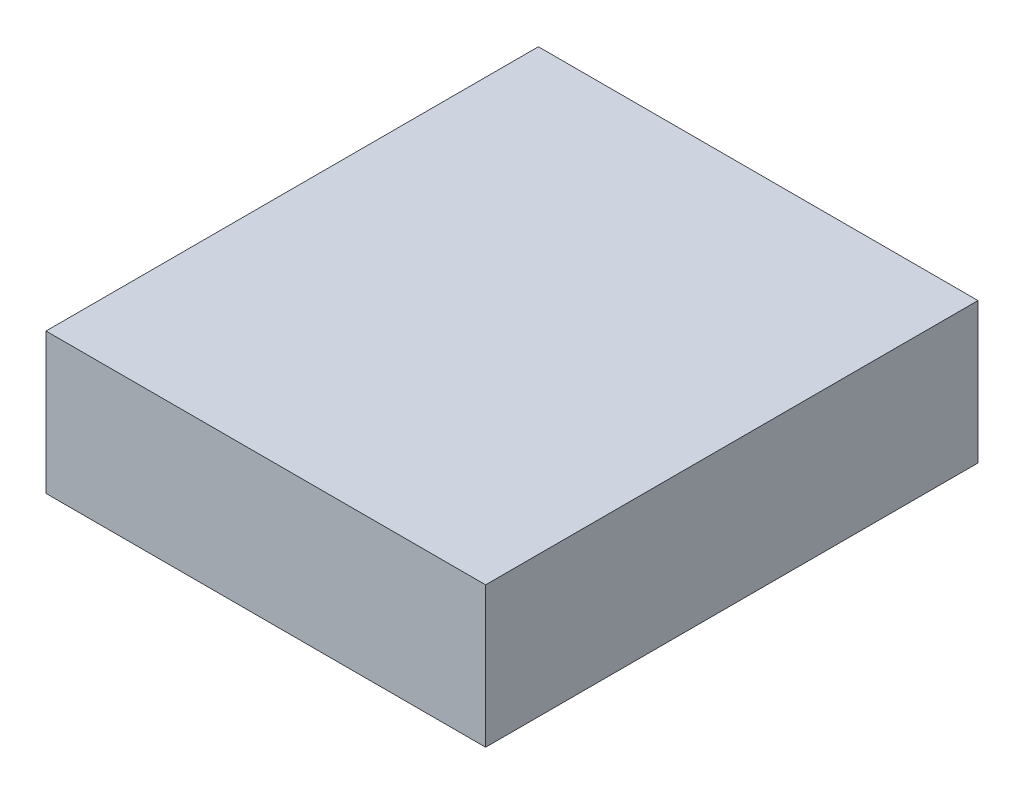
ISO-10303-21;
HEADER;
FILE_DESCRIPTION(('STEP AP214'),'2;1');
FILE_NAME('part.step','',(''),(''),'','','');
FILE_SCHEMA(('AUTOMOTIVE_DESIGN { 1 0 10303 214 1 1 1 1 }'));
ENDSEC;
DATA;
#1=APPLICATION_CONTEXT('core data for automotive mechanical design processes');
#2=APPLICATION_PROTOCOL_DEFINITION('international standard','automotive_design',2000,#1);
#3=PRODUCT_CONTEXT('',#1,'mechanical');
#4=PRODUCT('Part','Part','',(#3));
#5=PRODUCT_RELATED_PRODUCT_CATEGORY('part','',(#4));
#6=PRODUCT_DEFINITION_FORMATION('','',#4);
#7=PRODUCT_DEFINITION_CONTEXT('part definition',#1,'design');
#8=PRODUCT_DEFINITION('design','',#6,#7);
#9=PRODUCT_DEFINITION_SHAPE('','',#8);
#10=(LENGTH_UNIT() NAMED_UNIT(*) SI_UNIT(.MILLI.,.METRE.));
#11=(NAMED_UNIT(*) PLANE_ANGLE_UNIT() SI_UNIT($,.RADIAN.));
#12=(NAMED_UNIT(*) SI_UNIT($,.STERADIAN.) SOLID_ANGLE_UNIT());
#13=UNCERTAINTY_MEASURE_WITH_UNIT(LENGTH_MEASURE(1.E-05),#10,'distance_accuracy_value','');
#14=(GEOMETRIC_REPRESENTATION_CONTEXT(3) GLOBAL_UNCERTAINTY_ASSIGNED_CONTEXT((#13)) GLOBAL_UNIT_ASSIGNED_CONTEXT((#10,
#11,#12)) REPRESENTATION_CONTEXT('',''));
#15=CARTESIAN_POINT('',(0.,0.,0.));
#16=DIRECTION('',(0.,0.,1.));
#17=DIRECTION('',(1.,0.,0.));
#18=AXIS2_PLACEMENT_3D('',#15,#16,#17);
#19=CARTESIAN_POINT('',(-0.62500002,-0.1999996,0.));
#20=DIRECTION('',(0.,1.,0.));
#21=DIRECTION('',(0.,0.,1.));
#22=AXIS2_PLACEMENT_3D('',#19,#20,#21);
#23=PLANE('',#22);
#24=DIRECTION('',(0.,0.,1.));
#25=VECTOR('',#24,1.);
#26=CARTESIAN_POINT('',(0.62500002,-0.1999996,0.));
#27=LINE('',#26,#25);
#28=CARTESIAN_POINT('',(0.62500002,-0.1999996,0.));
#29=VERTEX_POINT('',#28);
#30=CARTESIAN_POINT('',(0.62500002,-0.1999996,1.39999974));
#31=VERTEX_POINT('',#30);
#32=EDGE_CURVE('E20',#29,#31,#27,.T.);
#33=ORIENTED_EDGE('',*,*,#32,.T.);
#34=DIRECTION('',(-1.,0.,0.));
#35=VECTOR('',#34,1.);
#36=CARTESIAN_POINT('',(0.62500002,-0.1999996,1.39999974));
#37=LINE('',#36,#35);
#38=CARTESIAN_POINT('',(-0.62500002,-0.1999996,1.39999974));
#39=VERTEX_POINT('',#38);
#40=EDGE_CURVE('E55',#31,#39,#37,.T.);
#41=ORIENTED_EDGE('',*,*,#40,.T.);
#42=DIRECTION('',(0.,0.,-1.));
#43=VECTOR('',#42,1.);
#44=CARTESIAN_POINT('',(-0.62500002,-0.1999996,0.));
#45=LINE('',#44,#43);
#46=CARTESIAN_POINT('',(-0.62500002,-0.1999996,0.));
#47=VERTEX_POINT('',#46);
#48=EDGE_CURVE('E74',#39,#47,#45,.T.);
#49=ORIENTED_EDGE('',*,*,#48,.T.);
#50=DIRECTION('',(-1.,0.,0.));
#51=VECTOR('',#50,1.);
#52=CARTESIAN_POINT('',(0.62500002,-0.1999996,0.));
#53=LINE('',#52,#51);
#54=EDGE_CURVE('E66',#29,#47,#53,.T.);
#55=ORIENTED_EDGE('',*,*,#54,.F.);
#56=EDGE_LOOP('',(#33,#41,#49,#55));
#57=FACE_BOUND('',#56,.T.);
#58=ADVANCED_FACE('F17',(#57),#23,.F.);
#59=CARTESIAN_POINT('',(0.62500002,-0.1999996,0.));
#60=DIRECTION('',(-1.,0.,0.));
#61=DIRECTION('',(0.,0.,1.));
#62=AXIS2_PLACEMENT_3D('',#59,#60,#61);
#63=PLANE('',#62);
#64=DIRECTION('',(0.,0.,-1.));
#65=VECTOR('',#64,1.);
#66=CARTESIAN_POINT('',(0.62500002,0.1999996,0.));
#67=LINE('',#66,#65);
#68=CARTESIAN_POINT('',(0.62500002,0.1999996,0.));
#69=VERTEX_POINT('',#68);
#70=CARTESIAN_POINT('',(0.62500002,0.1999996,1.39999974));
#71=VERTEX_POINT('',#70);
#72=EDGE_CURVE('E72',#69,#71,#67,.F.);
#73=ORIENTED_EDGE('',*,*,#72,.T.);
#74=DIRECTION('',(0.,1.,0.));
#75=VECTOR('',#74,1.);
#76=CARTESIAN_POINT('',(0.62500002,-0.1999996,1.39999974));
#77=LINE('',#76,#75);
#78=EDGE_CURVE('E62',#71,#31,#77,.F.);
#79=ORIENTED_EDGE('',*,*,#78,.T.);
#80=ORIENTED_EDGE('',*,*,#32,.F.);
#81=DIRECTION('',(0.,1.,0.));
#82=VECTOR('',#81,1.);
#83=CARTESIAN_POINT('',(0.62500002,-0.1999996,0.));
#84=LINE('',#83,#82);
#85=EDGE_CURVE('E80',#69,#29,#84,.F.);
#86=ORIENTED_EDGE('',*,*,#85,.F.);
#87=EDGE_LOOP('',(#73,#79,#80,#86));
#88=FACE_BOUND('',#87,.T.);
#89=ADVANCED_FACE('F71',(#88),#63,.F.);
#90=CARTESIAN_POINT('',(0.62500002,-0.1999996,1.39999974));
#91=DIRECTION('',(0.,0.,-1.));
#92=DIRECTION('',(-1.,0.,0.));
#93=AXIS2_PLACEMENT_3D('',#90,#91,#92);
#94=PLANE('',#93);
#95=DIRECTION('',(1.,0.,0.));
#96=VECTOR('',#95,1.);
#97=CARTESIAN_POINT('',(0.62500002,0.1999996,1.39999974));
#98=LINE('',#97,#96);
#99=CARTESIAN_POINT('',(-0.62500002,0.1999996,1.39999974));
#100=VERTEX_POINT('',#99);
#101=EDGE_CURVE('E83',#71,#100,#98,.F.);
#102=ORIENTED_EDGE('',*,*,#101,.T.);
#103=DIRECTION('',(0.,1.,0.));
#104=VECTOR('',#103,1.);
#105=CARTESIAN_POINT('',(-0.62500002,0.1999996,1.39999974));
#106=LINE('',#105,#104);
#107=EDGE_CURVE('E64',#100,#39,#106,.F.);
#108=ORIENTED_EDGE('',*,*,#107,.T.);
#109=ORIENTED_EDGE('',*,*,#40,.F.);
#110=ORIENTED_EDGE('',*,*,#78,.F.);
#111=EDGE_LOOP('',(#102,#108,#109,#110));
#112=FACE_BOUND('',#111,.T.);
#113=ADVANCED_FACE('F60',(#112),#94,.F.);
#114=CARTESIAN_POINT('',(-0.62500002,0.1999996,0.));
#115=DIRECTION('',(1.,0.,0.));
#116=DIRECTION('',(0.,0.,-1.));
#117=AXIS2_PLACEMENT_3D('',#114,#115,#116);
#118=PLANE('',#117);
#119=ORIENTED_EDGE('',*,*,#48,.F.);
#120=ORIENTED_EDGE('',*,*,#107,.F.);
#121=DIRECTION('',(0.,0.,-1.));
#122=VECTOR('',#121,1.);
#123=CARTESIAN_POINT('',(-0.62500002,0.1999996,0.));
#124=LINE('',#123,#122);
#125=CARTESIAN_POINT('',(-0.62500002,0.1999996,0.));
#126=VERTEX_POINT('',#125);
#127=EDGE_CURVE('E26',#100,#126,#124,.T.);
#128=ORIENTED_EDGE('',*,*,#127,.T.);
#129=DIRECTION('',(0.,1.,0.));
#130=VECTOR('',#129,1.);
#131=CARTESIAN_POINT('',(-0.62500002,-0.1999996,0.));
#132=LINE('',#131,#130);
#133=EDGE_CURVE('E34',#47,#126,#132,.T.);
#134=ORIENTED_EDGE('',*,*,#133,.F.);
#135=EDGE_LOOP('',(#119,#120,#128,#134));
#136=FACE_BOUND('',#135,.T.);
#137=ADVANCED_FACE('F88',(#136),#118,.F.);
#138=CARTESIAN_POINT('',(0.62500002,-0.1999996,0.));
#139=DIRECTION('',(0.,0.,-1.));
#140=DIRECTION('',(-1.,0.,0.));
#141=AXIS2_PLACEMENT_3D('',#138,#139,#140);
#142=PLANE('',#141);
#143=DIRECTION('',(1.,0.,0.));
#144=VECTOR('',#143,1.);
#145=CARTESIAN_POINT('',(0.62500002,0.1999996,0.));
#146=LINE('',#145,#144);
#147=EDGE_CURVE('E11',#126,#69,#146,.T.);
#148=ORIENTED_EDGE('',*,*,#147,.T.);
#149=ORIENTED_EDGE('',*,*,#85,.T.);
#150=ORIENTED_EDGE('',*,*,#54,.T.);
#151=ORIENTED_EDGE('',*,*,#133,.T.);
#152=EDGE_LOOP('',(#148,#149,#150,#151));
#153=FACE_BOUND('',#152,.T.);
#154=ADVANCED_FACE('F91',(#153),#142,.T.);
#155=CARTESIAN_POINT('',(0.62500002,0.1999996,0.));
#156=DIRECTION('',(0.,-1.,0.));
#157=DIRECTION('',(0.,0.,-1.));
#158=AXIS2_PLACEMENT_3D('',#155,#156,#157);
#159=PLANE('',#158);
#160=ORIENTED_EDGE('',*,*,#127,.F.);
#161=ORIENTED_EDGE('',*,*,#101,.F.);
#162=ORIENTED_EDGE('',*,*,#72,.F.);
#163=ORIENTED_EDGE('',*,*,#147,.F.);
#164=EDGE_LOOP('',(#160,#161,#162,#163));
#165=FACE_BOUND('',#164,.T.);
#166=ADVANCED_FACE('F90',(#165),#159,.F.);
#167=CLOSED_SHELL('',(#58,#89,#113,#137,#154,#166));
#168=MANIFOLD_SOLID_BREP('B1',#167);
#169=ADVANCED_BREP_SHAPE_REPRESENTATION('',(#18,#168),#14);
#170=SHAPE_DEFINITION_REPRESENTATION(#9,#169);
ENDSEC;
END-ISO-10303-21;
